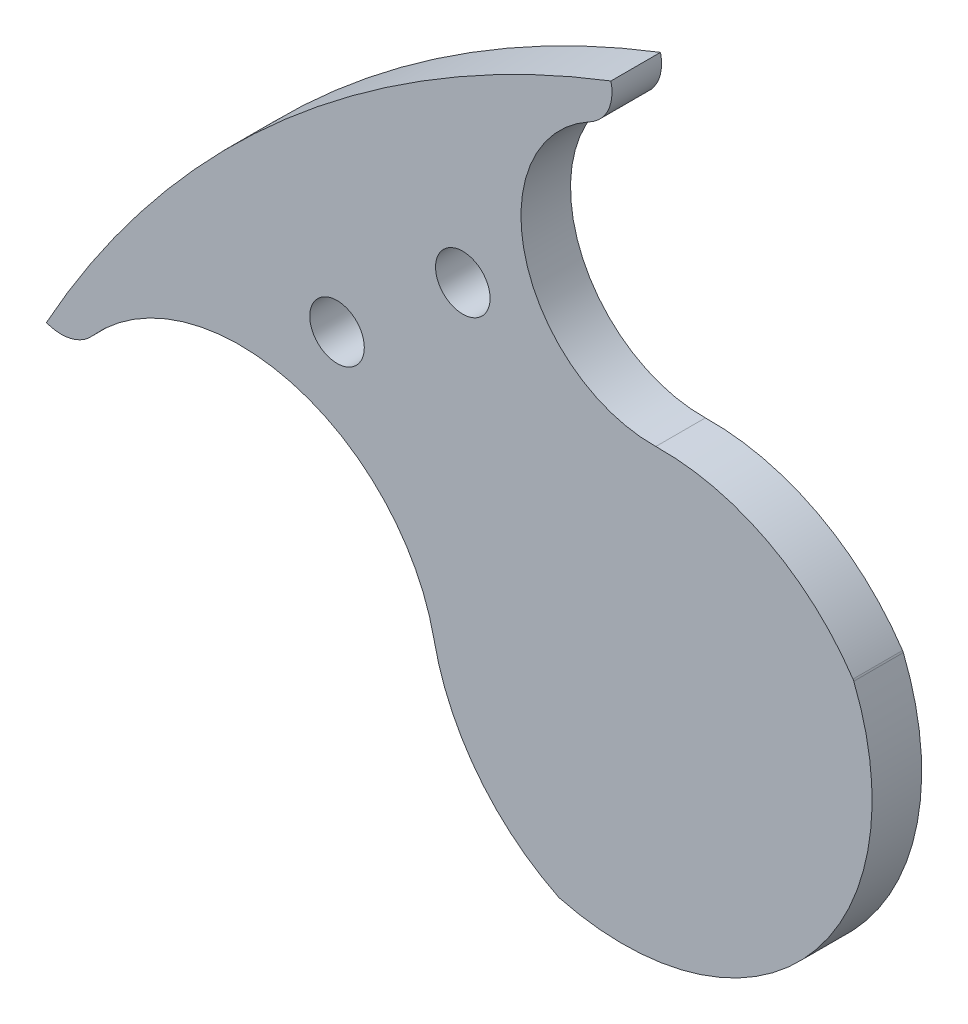
ISO-10303-21;
HEADER;
FILE_DESCRIPTION(('STEP AP214'),'2;1');
FILE_NAME('part.step','',(''),(''),'','','');
FILE_SCHEMA(('AUTOMOTIVE_DESIGN { 1 0 10303 214 1 1 1 1 }'));
ENDSEC;
DATA;
#1=APPLICATION_CONTEXT('core data for automotive mechanical design processes');
#2=APPLICATION_PROTOCOL_DEFINITION('international standard','automotive_design',2000,#1);
#3=PRODUCT_CONTEXT('',#1,'mechanical');
#4=PRODUCT('Part','Part','',(#3));
#5=PRODUCT_RELATED_PRODUCT_CATEGORY('part','',(#4));
#6=PRODUCT_DEFINITION_FORMATION('','',#4);
#7=PRODUCT_DEFINITION_CONTEXT('part definition',#1,'design');
#8=PRODUCT_DEFINITION('design','',#6,#7);
#9=PRODUCT_DEFINITION_SHAPE('','',#8);
#10=(LENGTH_UNIT() NAMED_UNIT(*) SI_UNIT(.MILLI.,.METRE.));
#11=(NAMED_UNIT(*) PLANE_ANGLE_UNIT() SI_UNIT($,.RADIAN.));
#12=(NAMED_UNIT(*) SI_UNIT($,.STERADIAN.) SOLID_ANGLE_UNIT());
#13=UNCERTAINTY_MEASURE_WITH_UNIT(LENGTH_MEASURE(1.E-05),#10,'distance_accuracy_value','');
#14=(GEOMETRIC_REPRESENTATION_CONTEXT(3) GLOBAL_UNCERTAINTY_ASSIGNED_CONTEXT((#13)) GLOBAL_UNIT_ASSIGNED_CONTEXT((#10,
#11,#12)) REPRESENTATION_CONTEXT('',''));
#15=CARTESIAN_POINT('',(0.,0.,0.));
#16=DIRECTION('',(0.,0.,1.));
#17=DIRECTION('',(1.,0.,0.));
#18=AXIS2_PLACEMENT_3D('',#15,#16,#17);
#19=CARTESIAN_POINT('',(-26.7010678237439,17.8461905154121,3.));
#20=DIRECTION('',(0.,0.,-1.));
#21=DIRECTION('',(-1.,0.,0.));
#22=AXIS2_PLACEMENT_3D('',#19,#20,#21);
#23=CYLINDRICAL_SURFACE('',#22,0.500000000000046);
#24=CARTESIAN_POINT('',(-26.7010678237439,17.8461905154121,0.));
#25=DIRECTION('',(0.,0.,1.));
#26=DIRECTION('',(1.,0.,0.));
#27=AXIS2_PLACEMENT_3D('',#24,#25,#26);
#28=CIRCLE('',#27,0.500000000000046);
#29=CARTESIAN_POINT('',(-26.9224338575576,17.397863537556,0.));
#30=VERTEX_POINT('',#29);
#31=CARTESIAN_POINT('',(-26.8277526904714,17.3625057580109,0.));
#32=VERTEX_POINT('',#31);
#33=EDGE_CURVE('E158',#30,#32,#28,.T.);
#34=ORIENTED_EDGE('',*,*,#33,.T.);
#35=DIRECTION('',(0.,0.,-1.));
#36=VECTOR('',#35,1.);
#37=CARTESIAN_POINT('',(-26.8277526904714,17.3625057580109,3.));
#38=LINE('',#37,#36);
#39=CARTESIAN_POINT('',(-26.8277526904714,17.3625057580109,3.));
#40=VERTEX_POINT('',#39);
#41=EDGE_CURVE('E11',#40,#32,#38,.T.);
#42=ORIENTED_EDGE('',*,*,#41,.F.);
#43=CARTESIAN_POINT('',(-26.7010678237439,17.8461905154121,3.));
#44=DIRECTION('',(0.,0.,1.));
#45=DIRECTION('',(1.,0.,0.));
#46=AXIS2_PLACEMENT_3D('',#43,#44,#45);
#47=CIRCLE('',#46,0.500000000000046);
#48=CARTESIAN_POINT('',(-26.9224338575576,17.397863537556,3.));
#49=VERTEX_POINT('',#48);
#50=EDGE_CURVE('E187',#49,#40,#47,.T.);
#51=ORIENTED_EDGE('',*,*,#50,.F.);
#52=DIRECTION('',(0.,0.,-1.));
#53=VECTOR('',#52,1.);
#54=CARTESIAN_POINT('',(-26.9224338575576,17.397863537556,3.));
#55=LINE('',#54,#53);
#56=EDGE_CURVE('E154',#49,#30,#55,.T.);
#57=ORIENTED_EDGE('',*,*,#56,.T.);
#58=EDGE_LOOP('',(#34,#42,#51,#57));
#59=FACE_BOUND('',#58,.T.);
#60=ADVANCED_FACE('F45',(#59),#23,.T.);
#61=CARTESIAN_POINT('',(-23.0059791716341,31.954095464443,3.));
#62=DIRECTION('',(0.,0.,-1.));
#63=DIRECTION('',(-1.,0.,0.));
#64=AXIS2_PLACEMENT_3D('',#61,#62,#63);
#65=CYLINDRICAL_SURFACE('',#64,15.0837807922994);
#66=CARTESIAN_POINT('',(-23.0059791716341,31.954095464443,0.));
#67=DIRECTION('',(0.,0.,1.));
#68=DIRECTION('',(1.,0.,0.));
#69=AXIS2_PLACEMENT_3D('',#66,#67,#68);
#70=CIRCLE('',#69,15.0837807922994);
#71=CARTESIAN_POINT('',(-9.03244079588374,37.6339430197541,0.));
#72=VERTEX_POINT('',#71);
#73=EDGE_CURVE('E162',#32,#72,#70,.T.);
#74=ORIENTED_EDGE('',*,*,#73,.T.);
#75=DIRECTION('',(0.,0.,-1.));
#76=VECTOR('',#75,1.);
#77=CARTESIAN_POINT('',(-9.03244079588374,37.6339430197541,3.));
#78=LINE('',#77,#76);
#79=CARTESIAN_POINT('',(-9.03244079588374,37.6339430197541,3.));
#80=VERTEX_POINT('',#79);
#81=EDGE_CURVE('E54',#80,#72,#78,.T.);
#82=ORIENTED_EDGE('',*,*,#81,.F.);
#83=CARTESIAN_POINT('',(-23.0059791716341,31.954095464443,3.));
#84=DIRECTION('',(0.,0.,1.));
#85=DIRECTION('',(1.,0.,0.));
#86=AXIS2_PLACEMENT_3D('',#83,#84,#85);
#87=CIRCLE('',#86,15.0837807922994);
#88=EDGE_CURVE('E111',#40,#80,#87,.T.);
#89=ORIENTED_EDGE('',*,*,#88,.F.);
#90=ORIENTED_EDGE('',*,*,#41,.T.);
#91=EDGE_LOOP('',(#74,#82,#89,#90));
#92=FACE_BOUND('',#91,.T.);
#93=ADVANCED_FACE('F287',(#92),#65,.T.);
#94=CARTESIAN_POINT('',(-9.49563827164142,37.4456663657268,3.));
#95=DIRECTION('',(0.,0.,-1.));
#96=DIRECTION('',(-1.,0.,0.));
#97=AXIS2_PLACEMENT_3D('',#94,#95,#96);
#98=CYLINDRICAL_SURFACE('',#97,0.499999999999979);
#99=CARTESIAN_POINT('',(-9.49563827164142,37.4456663657268,0.));
#100=DIRECTION('',(0.,0.,1.));
#101=DIRECTION('',(-1.,0.,0.));
#102=AXIS2_PLACEMENT_3D('',#99,#100,#101);
#103=CIRCLE('',#102,0.499999999999979);
#104=CARTESIAN_POINT('',(-9.07976617389575,37.7232459008453,0.));
#105=VERTEX_POINT('',#104);
#106=EDGE_CURVE('E166',#72,#105,#103,.T.);
#107=ORIENTED_EDGE('',*,*,#106,.T.);
#108=DIRECTION('',(0.,0.,-1.));
#109=VECTOR('',#108,1.);
#110=CARTESIAN_POINT('',(-9.07976617389575,37.7232459008453,3.));
#111=LINE('',#110,#109);
#112=CARTESIAN_POINT('',(-9.07976617389575,37.7232459008453,3.));
#113=VERTEX_POINT('',#112);
#114=EDGE_CURVE('E206',#113,#105,#111,.T.);
#115=ORIENTED_EDGE('',*,*,#114,.F.);
#116=CARTESIAN_POINT('',(-9.49563827164142,37.4456663657268,3.));
#117=DIRECTION('',(0.,0.,1.));
#118=DIRECTION('',(-1.,0.,0.));
#119=AXIS2_PLACEMENT_3D('',#116,#117,#118);
#120=CIRCLE('',#119,0.499999999999979);
#121=EDGE_CURVE('E216',#80,#113,#120,.T.);
#122=ORIENTED_EDGE('',*,*,#121,.F.);
#123=ORIENTED_EDGE('',*,*,#81,.T.);
#124=EDGE_LOOP('',(#107,#115,#122,#123));
#125=FACE_BOUND('',#124,.T.);
#126=ADVANCED_FACE('F214',(#125),#98,.T.);
#127=CARTESIAN_POINT('',(-20.7241849107752,29.9510189175276,3.));
#128=DIRECTION('',(0.,0.,-1.));
#129=DIRECTION('',(-1.,0.,0.));
#130=AXIS2_PLACEMENT_3D('',#127,#128,#129);
#131=CYLINDRICAL_SURFACE('',#130,14.0000000000001);
#132=CARTESIAN_POINT('',(-20.7241849107752,29.9510189175276,0.));
#133=DIRECTION('',(0.,0.,1.));
#134=DIRECTION('',(1.,0.,0.));
#135=AXIS2_PLACEMENT_3D('',#132,#133,#134);
#136=CIRCLE('',#135,14.0000000000001);
#137=CARTESIAN_POINT('',(-21.0113495176026,43.9480734822776,0.));
#138=VERTEX_POINT('',#137);
#139=EDGE_CURVE('E169',#105,#138,#136,.T.);
#140=ORIENTED_EDGE('',*,*,#139,.T.);
#141=DIRECTION('',(0.,0.,-1.));
#142=VECTOR('',#141,1.);
#143=CARTESIAN_POINT('',(-21.0113495176026,43.9480734822776,3.));
#144=LINE('',#143,#142);
#145=CARTESIAN_POINT('',(-21.0113495176026,43.9480734822776,3.));
#146=VERTEX_POINT('',#145);
#147=EDGE_CURVE('E202',#146,#138,#144,.T.);
#148=ORIENTED_EDGE('',*,*,#147,.F.);
#149=CARTESIAN_POINT('',(-20.7241849107752,29.9510189175276,3.));
#150=DIRECTION('',(0.,0.,1.));
#151=DIRECTION('',(1.,0.,0.));
#152=AXIS2_PLACEMENT_3D('',#149,#150,#151);
#153=CIRCLE('',#152,14.0000000000001);
#154=EDGE_CURVE('E235',#113,#146,#153,.T.);
#155=ORIENTED_EDGE('',*,*,#154,.F.);
#156=ORIENTED_EDGE('',*,*,#114,.T.);
#157=EDGE_LOOP('',(#140,#148,#155,#156));
#158=FACE_BOUND('',#157,.T.);
#159=ADVANCED_FACE('F225',(#158),#131,.T.);
#160=CARTESIAN_POINT('',(-21.1754435786468,51.9463903764204,3.));
#161=DIRECTION('',(0.,0.,-1.));
#162=DIRECTION('',(-1.,0.,0.));
#163=AXIS2_PLACEMENT_3D('',#160,#161,#162);
#164=CYLINDRICAL_SURFACE('',#163,8.00000000000001);
#165=CARTESIAN_POINT('',(-21.1754435786468,51.9463903764204,0.));
#166=DIRECTION('',(0.,0.,-1.));
#167=DIRECTION('',(1.,0.,0.));
#168=AXIS2_PLACEMENT_3D('',#165,#166,#167);
#169=CIRCLE('',#168,8.00000000000001);
#170=CARTESIAN_POINT('',(-24.9764810463853,58.9857166345823,0.));
#171=VERTEX_POINT('',#170);
#172=EDGE_CURVE('E172',#138,#171,#169,.T.);
#173=ORIENTED_EDGE('',*,*,#172,.T.);
#174=DIRECTION('',(0.,0.,-1.));
#175=VECTOR('',#174,1.);
#176=CARTESIAN_POINT('',(-24.9764810463853,58.9857166345823,3.));
#177=LINE('',#176,#175);
#178=CARTESIAN_POINT('',(-24.9764810463853,58.9857166345823,3.));
#179=VERTEX_POINT('',#178);
#180=EDGE_CURVE('E198',#179,#171,#177,.T.);
#181=ORIENTED_EDGE('',*,*,#180,.F.);
#182=CARTESIAN_POINT('',(-21.1754435786468,51.9463903764204,3.));
#183=DIRECTION('',(0.,0.,-1.));
#184=DIRECTION('',(1.,0.,0.));
#185=AXIS2_PLACEMENT_3D('',#182,#183,#184);
#186=CIRCLE('',#185,8.00000000000001);
#187=EDGE_CURVE('E231',#146,#179,#186,.T.);
#188=ORIENTED_EDGE('',*,*,#187,.F.);
#189=ORIENTED_EDGE('',*,*,#147,.T.);
#190=EDGE_LOOP('',(#173,#181,#188,#189));
#191=FACE_BOUND('',#190,.T.);
#192=ADVANCED_FACE('F229',(#191),#164,.F.);
#193=CARTESIAN_POINT('',(-26.1643052550535,61.185506090258,3.));
#194=DIRECTION('',(0.,0.,-1.));
#195=DIRECTION('',(-1.,0.,0.));
#196=AXIS2_PLACEMENT_3D('',#193,#194,#195);
#197=CYLINDRICAL_SURFACE('',#196,2.50000000000001);
#198=CARTESIAN_POINT('',(-26.1643052550535,61.185506090258,0.));
#199=DIRECTION('',(0.,0.,1.));
#200=DIRECTION('',(-1.,0.,0.));
#201=AXIS2_PLACEMENT_3D('',#198,#199,#200);
#202=CIRCLE('',#201,2.50000000000001);
#203=CARTESIAN_POINT('',(-23.7283549115233,61.747774641624,0.));
#204=VERTEX_POINT('',#203);
#205=EDGE_CURVE('E175',#171,#204,#202,.T.);
#206=ORIENTED_EDGE('',*,*,#205,.T.);
#207=DIRECTION('',(0.,0.,-1.));
#208=VECTOR('',#207,1.);
#209=CARTESIAN_POINT('',(-23.7283549115233,61.747774641624,3.));
#210=LINE('',#209,#208);
#211=CARTESIAN_POINT('',(-23.7283549115233,61.747774641624,3.));
#212=VERTEX_POINT('',#211);
#213=EDGE_CURVE('E194',#212,#204,#210,.T.);
#214=ORIENTED_EDGE('',*,*,#213,.F.);
#215=CARTESIAN_POINT('',(-26.1643052550535,61.185506090258,3.));
#216=DIRECTION('',(0.,0.,1.));
#217=DIRECTION('',(-1.,0.,0.));
#218=AXIS2_PLACEMENT_3D('',#215,#216,#217);
#219=CIRCLE('',#218,2.50000000000001);
#220=EDGE_CURVE('E234',#179,#212,#219,.T.);
#221=ORIENTED_EDGE('',*,*,#220,.F.);
#222=ORIENTED_EDGE('',*,*,#180,.T.);
#223=EDGE_LOOP('',(#206,#214,#221,#222));
#224=FACE_BOUND('',#223,.T.);
#225=ADVANCED_FACE('F299',(#224),#197,.T.);
#226=CARTESIAN_POINT('',(0.,0.,3.));
#227=DIRECTION('',(0.,0.,-1.));
#228=DIRECTION('',(-1.,0.,0.));
#229=AXIS2_PLACEMENT_3D('',#226,#227,#228);
#230=CYLINDRICAL_SURFACE('',#229,66.15);
#231=CARTESIAN_POINT('',(0.,0.,0.));
#232=DIRECTION('',(0.,0.,1.));
#233=DIRECTION('',(1.,0.,0.));
#234=AXIS2_PLACEMENT_3D('',#231,#232,#233);
#235=CIRCLE('',#234,66.15);
#236=CARTESIAN_POINT('',(-57.8948379477004,32.0001599841237,0.));
#237=VERTEX_POINT('',#236);
#238=EDGE_CURVE('E178',#204,#237,#235,.T.);
#239=ORIENTED_EDGE('',*,*,#238,.T.);
#240=DIRECTION('',(0.,0.,-1.));
#241=VECTOR('',#240,1.);
#242=CARTESIAN_POINT('',(-57.8948379477004,32.0001599841237,3.));
#243=LINE('',#242,#241);
#244=CARTESIAN_POINT('',(-57.8948379477004,32.0001599841237,3.));
#245=VERTEX_POINT('',#244);
#246=EDGE_CURVE('E147',#245,#237,#243,.T.);
#247=ORIENTED_EDGE('',*,*,#246,.F.);
#248=CARTESIAN_POINT('',(0.,0.,3.));
#249=DIRECTION('',(0.,0.,1.));
#250=DIRECTION('',(1.,0.,0.));
#251=AXIS2_PLACEMENT_3D('',#248,#249,#250);
#252=CIRCLE('',#251,66.15);
#253=EDGE_CURVE('E136',#212,#245,#252,.T.);
#254=ORIENTED_EDGE('',*,*,#253,.F.);
#255=ORIENTED_EDGE('',*,*,#213,.T.);
#256=EDGE_LOOP('',(#239,#247,#254,#255));
#257=FACE_BOUND('',#256,.T.);
#258=ADVANCED_FACE('F296',(#257),#230,.T.);
#259=CARTESIAN_POINT('',(-57.0026899205622,34.3355554319383,3.));
#260=DIRECTION('',(0.,0.,-1.));
#261=DIRECTION('',(-1.,0.,0.));
#262=AXIS2_PLACEMENT_3D('',#259,#260,#261);
#263=CYLINDRICAL_SURFACE('',#262,2.49999999999997);
#264=CARTESIAN_POINT('',(-57.0026899205622,34.3355554319383,0.));
#265=DIRECTION('',(0.,0.,1.));
#266=DIRECTION('',(1.,0.,0.));
#267=AXIS2_PLACEMENT_3D('',#264,#265,#266);
#268=CIRCLE('',#267,2.49999999999997);
#269=CARTESIAN_POINT('',(-55.13747322627,32.6709333477,0.));
#270=VERTEX_POINT('',#269);
#271=EDGE_CURVE('E145',#237,#270,#268,.T.);
#272=ORIENTED_EDGE('',*,*,#271,.T.);
#273=DIRECTION('',(0.,0.,-1.));
#274=VECTOR('',#273,1.);
#275=CARTESIAN_POINT('',(-55.13747322627,32.6709333477,3.));
#276=LINE('',#275,#274);
#277=CARTESIAN_POINT('',(-55.13747322627,32.6709333477,3.));
#278=VERTEX_POINT('',#277);
#279=EDGE_CURVE('E142',#278,#270,#276,.T.);
#280=ORIENTED_EDGE('',*,*,#279,.F.);
#281=CARTESIAN_POINT('',(-57.0026899205622,34.3355554319383,3.));
#282=DIRECTION('',(0.,0.,1.));
#283=DIRECTION('',(1.,0.,0.));
#284=AXIS2_PLACEMENT_3D('',#281,#282,#283);
#285=CIRCLE('',#284,2.49999999999997);
#286=EDGE_CURVE('E130',#245,#278,#285,.T.);
#287=ORIENTED_EDGE('',*,*,#286,.F.);
#288=ORIENTED_EDGE('',*,*,#246,.T.);
#289=EDGE_LOOP('',(#272,#280,#287,#288));
#290=FACE_BOUND('',#289,.T.);
#291=ADVANCED_FACE('F143',(#290),#263,.T.);
#292=CARTESIAN_POINT('',(-46.1844330936677,24.6807473433562,3.));
#293=DIRECTION('',(0.,0.,-1.));
#294=DIRECTION('',(-1.,0.,0.));
#295=AXIS2_PLACEMENT_3D('',#292,#293,#294);
#296=CYLINDRICAL_SURFACE('',#295,12.);
#297=CARTESIAN_POINT('',(-46.1844330936677,24.6807473433562,0.));
#298=DIRECTION('',(0.,0.,-1.));
#299=DIRECTION('',(-1.,0.,0.));
#300=AXIS2_PLACEMENT_3D('',#297,#298,#299);
#301=CIRCLE('',#300,12.);
#302=CARTESIAN_POINT('',(-34.4335493169481,27.1131803775892,0.));
#303=VERTEX_POINT('',#302);
#304=EDGE_CURVE('E97',#270,#303,#301,.T.);
#305=ORIENTED_EDGE('',*,*,#304,.T.);
#306=DIRECTION('',(0.,0.,-1.));
#307=VECTOR('',#306,1.);
#308=CARTESIAN_POINT('',(-34.4335493169481,27.1131803775892,3.));
#309=LINE('',#308,#307);
#310=CARTESIAN_POINT('',(-34.4335493169481,27.1131803775892,3.));
#311=VERTEX_POINT('',#310);
#312=EDGE_CURVE('E148',#311,#303,#309,.T.);
#313=ORIENTED_EDGE('',*,*,#312,.F.);
#314=CARTESIAN_POINT('',(-46.1844330936677,24.6807473433562,3.));
#315=DIRECTION('',(0.,0.,-1.));
#316=DIRECTION('',(-1.,0.,0.));
#317=AXIS2_PLACEMENT_3D('',#314,#315,#316);
#318=CIRCLE('',#317,12.);
#319=EDGE_CURVE('E134',#278,#311,#318,.T.);
#320=ORIENTED_EDGE('',*,*,#319,.F.);
#321=ORIENTED_EDGE('',*,*,#279,.T.);
#322=EDGE_LOOP('',(#305,#313,#320,#321));
#323=FACE_BOUND('',#322,.T.);
#324=ADVANCED_FACE('F150',(#323),#296,.F.);
#325=CARTESIAN_POINT('',(-20.7241849107752,29.9510189175276,3.));
#326=DIRECTION('',(0.,0.,-1.));
#327=DIRECTION('',(-1.,0.,0.));
#328=AXIS2_PLACEMENT_3D('',#325,#326,#327);
#329=CYLINDRICAL_SURFACE('',#328,14.);
#330=CARTESIAN_POINT('',(-20.7241849107752,29.9510189175276,0.));
#331=DIRECTION('',(0.,0.,1.));
#332=DIRECTION('',(1.,0.,0.));
#333=AXIS2_PLACEMENT_3D('',#330,#331,#332);
#334=CIRCLE('',#333,14.);
#335=EDGE_CURVE('E103',#303,#30,#334,.T.);
#336=ORIENTED_EDGE('',*,*,#335,.T.);
#337=ORIENTED_EDGE('',*,*,#56,.F.);
#338=CARTESIAN_POINT('',(-20.7241849107752,29.9510189175276,3.));
#339=DIRECTION('',(0.,0.,1.));
#340=DIRECTION('',(1.,0.,0.));
#341=AXIS2_PLACEMENT_3D('',#338,#339,#340);
#342=CIRCLE('',#341,14.);
#343=EDGE_CURVE('E62',#311,#49,#342,.T.);
#344=ORIENTED_EDGE('',*,*,#343,.F.);
#345=ORIENTED_EDGE('',*,*,#312,.T.);
#346=EDGE_LOOP('',(#336,#337,#344,#345));
#347=FACE_BOUND('',#346,.T.);
#348=ADVANCED_FACE('F270',(#347),#329,.T.);
#349=CARTESIAN_POINT('',(-24.853523497689,24.9001429899276,3.));
#350=DIRECTION('',(0.,0.,1.));
#351=DIRECTION('',(1.,0.,0.));
#352=AXIS2_PLACEMENT_3D('',#349,#350,#351);
#353=PLANE('',#352);
#354=CARTESIAN_POINT('',(-40.305086527633,40.3050865276334,3.));
#355=DIRECTION('',(0.,0.,1.));
#356=DIRECTION('',(1.,0.,0.));
#357=AXIS2_PLACEMENT_3D('',#354,#355,#356);
#358=CIRCLE('',#357,1.65);
#359=CARTESIAN_POINT('',(-38.655086527633,40.3050865276334,3.));
#360=VERTEX_POINT('',#359);
#361=EDGE_CURVE('E163',#360,#360,#358,.T.);
#362=ORIENTED_EDGE('',*,*,#361,.F.);
#363=EDGE_LOOP('',(#362));
#364=FACE_BOUND('',#363,.T.);
#365=CARTESIAN_POINT('',(-32.6938568720097,46.6916665244725,3.));
#366=DIRECTION('',(0.,0.,1.));
#367=DIRECTION('',(1.,0.,0.));
#368=AXIS2_PLACEMENT_3D('',#365,#366,#367);
#369=CIRCLE('',#368,1.65);
#370=CARTESIAN_POINT('',(-31.0438568720097,46.6916665244725,3.));
#371=VERTEX_POINT('',#370);
#372=EDGE_CURVE('E249',#371,#371,#369,.T.);
#373=ORIENTED_EDGE('',*,*,#372,.F.);
#374=EDGE_LOOP('',(#373));
#375=FACE_BOUND('',#374,.T.);
#376=ORIENTED_EDGE('',*,*,#50,.T.);
#377=ORIENTED_EDGE('',*,*,#88,.T.);
#378=ORIENTED_EDGE('',*,*,#121,.T.);
#379=ORIENTED_EDGE('',*,*,#154,.T.);
#380=ORIENTED_EDGE('',*,*,#187,.T.);
#381=ORIENTED_EDGE('',*,*,#220,.T.);
#382=ORIENTED_EDGE('',*,*,#253,.T.);
#383=ORIENTED_EDGE('',*,*,#286,.T.);
#384=ORIENTED_EDGE('',*,*,#319,.T.);
#385=ORIENTED_EDGE('',*,*,#343,.T.);
#386=EDGE_LOOP('',(#376,#377,#378,#379,#380,#381,#382,#383,#384,#385));
#387=FACE_BOUND('',#386,.T.);
#388=ADVANCED_FACE('F132',(#364,#375,#387),#353,.T.);
#389=CARTESIAN_POINT('',(-24.853523497689,24.9001429899276,0.));
#390=DIRECTION('',(0.,0.,1.));
#391=DIRECTION('',(1.,0.,0.));
#392=AXIS2_PLACEMENT_3D('',#389,#390,#391);
#393=PLANE('',#392);
#394=CARTESIAN_POINT('',(-40.305086527633,40.3050865276334,0.));
#395=DIRECTION('',(0.,0.,1.));
#396=DIRECTION('',(1.,0.,0.));
#397=AXIS2_PLACEMENT_3D('',#394,#395,#396);
#398=CIRCLE('',#397,1.65);
#399=CARTESIAN_POINT('',(-38.655086527633,40.3050865276334,0.));
#400=VERTEX_POINT('',#399);
#401=EDGE_CURVE('E257',#400,#400,#398,.T.);
#402=ORIENTED_EDGE('',*,*,#401,.T.);
#403=EDGE_LOOP('',(#402));
#404=FACE_BOUND('',#403,.T.);
#405=CARTESIAN_POINT('',(-32.6938568720097,46.6916665244725,0.));
#406=DIRECTION('',(0.,0.,1.));
#407=DIRECTION('',(1.,0.,0.));
#408=AXIS2_PLACEMENT_3D('',#405,#406,#407);
#409=CIRCLE('',#408,1.65);
#410=CARTESIAN_POINT('',(-31.0438568720097,46.6916665244725,0.));
#411=VERTEX_POINT('',#410);
#412=EDGE_CURVE('E253',#411,#411,#409,.T.);
#413=ORIENTED_EDGE('',*,*,#412,.T.);
#414=EDGE_LOOP('',(#413));
#415=FACE_BOUND('',#414,.T.);
#416=ORIENTED_EDGE('',*,*,#33,.F.);
#417=ORIENTED_EDGE('',*,*,#335,.F.);
#418=ORIENTED_EDGE('',*,*,#304,.F.);
#419=ORIENTED_EDGE('',*,*,#271,.F.);
#420=ORIENTED_EDGE('',*,*,#238,.F.);
#421=ORIENTED_EDGE('',*,*,#205,.F.);
#422=ORIENTED_EDGE('',*,*,#172,.F.);
#423=ORIENTED_EDGE('',*,*,#139,.F.);
#424=ORIENTED_EDGE('',*,*,#106,.F.);
#425=ORIENTED_EDGE('',*,*,#73,.F.);
#426=EDGE_LOOP('',(#416,#417,#418,#419,#420,#421,#422,#423,#424,#425));
#427=FACE_BOUND('',#426,.T.);
#428=ADVANCED_FACE('F220',(#404,#415,#427),#393,.F.);
#429=CARTESIAN_POINT('',(-32.6938568720097,46.6916665244725,3.));
#430=DIRECTION('',(0.,0.,-1.));
#431=DIRECTION('',(-1.,0.,0.));
#432=AXIS2_PLACEMENT_3D('',#429,#430,#431);
#433=CYLINDRICAL_SURFACE('',#432,1.65);
#434=ORIENTED_EDGE('',*,*,#372,.T.);
#435=EDGE_LOOP('',(#434));
#436=FACE_BOUND('',#435,.T.);
#437=ORIENTED_EDGE('',*,*,#412,.F.);
#438=EDGE_LOOP('',(#437));
#439=FACE_BOUND('',#438,.T.);
#440=ADVANCED_FACE('F274',(#436,#439),#433,.F.);
#441=CARTESIAN_POINT('',(-40.305086527633,40.3050865276334,3.));
#442=DIRECTION('',(0.,0.,-1.));
#443=DIRECTION('',(-1.,0.,0.));
#444=AXIS2_PLACEMENT_3D('',#441,#442,#443);
#445=CYLINDRICAL_SURFACE('',#444,1.65);
#446=ORIENTED_EDGE('',*,*,#361,.T.);
#447=EDGE_LOOP('',(#446));
#448=FACE_BOUND('',#447,.T.);
#449=ORIENTED_EDGE('',*,*,#401,.F.);
#450=EDGE_LOOP('',(#449));
#451=FACE_BOUND('',#450,.T.);
#452=ADVANCED_FACE('F265',(#448,#451),#445,.F.);
#453=CLOSED_SHELL('',(#60,#93,#126,#159,#192,#225,#258,#291,#324,#348,#388,#428,#440,#452));
#454=MANIFOLD_SOLID_BREP('B2',#453);
#455=ADVANCED_BREP_SHAPE_REPRESENTATION('',(#18,#454),#14);
#456=SHAPE_DEFINITION_REPRESENTATION(#9,#455);
ENDSEC;
END-ISO-10303-21;
